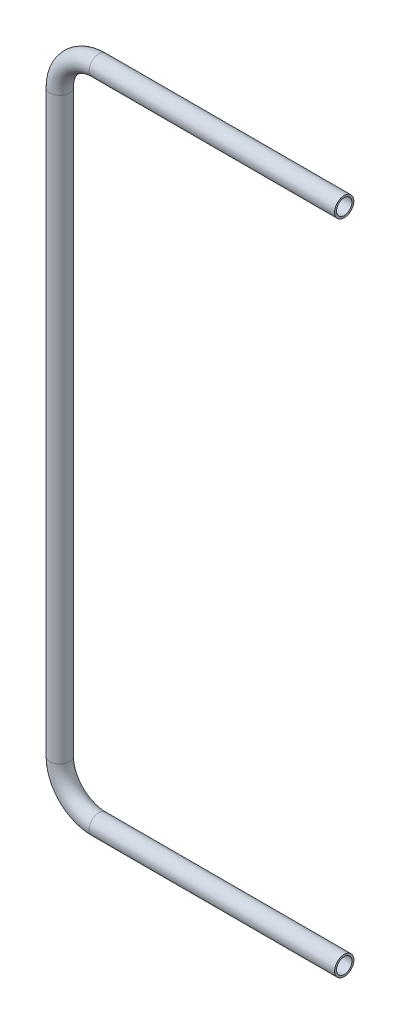
ISO-10303-21;
HEADER;
FILE_DESCRIPTION(('STEP AP214'),'2;1');
FILE_NAME('part.step','',(''),(''),'','','');
FILE_SCHEMA(('AUTOMOTIVE_DESIGN { 1 0 10303 214 1 1 1 1 }'));
ENDSEC;
DATA;
#1=APPLICATION_CONTEXT('core data for automotive mechanical design processes');
#2=APPLICATION_PROTOCOL_DEFINITION('international standard','automotive_design',2000,#1);
#3=PRODUCT_CONTEXT('',#1,'mechanical');
#4=PRODUCT('Part','Part','',(#3));
#5=PRODUCT_RELATED_PRODUCT_CATEGORY('part','',(#4));
#6=PRODUCT_DEFINITION_FORMATION('','',#4);
#7=PRODUCT_DEFINITION_CONTEXT('part definition',#1,'design');
#8=PRODUCT_DEFINITION('design','',#6,#7);
#9=PRODUCT_DEFINITION_SHAPE('','',#8);
#10=(LENGTH_UNIT() NAMED_UNIT(*) SI_UNIT(.MILLI.,.METRE.));
#11=(NAMED_UNIT(*) PLANE_ANGLE_UNIT() SI_UNIT($,.RADIAN.));
#12=(NAMED_UNIT(*) SI_UNIT($,.STERADIAN.) SOLID_ANGLE_UNIT());
#13=UNCERTAINTY_MEASURE_WITH_UNIT(LENGTH_MEASURE(1.E-05),#10,'distance_accuracy_value','');
#14=(GEOMETRIC_REPRESENTATION_CONTEXT(3) GLOBAL_UNCERTAINTY_ASSIGNED_CONTEXT((#13)) GLOBAL_UNIT_ASSIGNED_CONTEXT((#10,
#11,#12)) REPRESENTATION_CONTEXT('',''));
#15=CARTESIAN_POINT('',(0.,0.,0.));
#16=DIRECTION('',(0.,0.,1.));
#17=DIRECTION('',(1.,0.,0.));
#18=AXIS2_PLACEMENT_3D('',#15,#16,#17);
#19=CARTESIAN_POINT('',(0.,0.,0.));
#20=DIRECTION('',(-1.,0.,0.));
#21=DIRECTION('',(0.,-1.,0.));
#22=AXIS2_PLACEMENT_3D('',#19,#20,#21);
#23=CYLINDRICAL_SURFACE('',#22,16.7005);
#24=CARTESIAN_POINT('',(-423.799,0.,0.));
#25=DIRECTION('',(1.,0.,0.));
#26=DIRECTION('',(0.,0.,-1.));
#27=AXIS2_PLACEMENT_3D('',#24,#25,#26);
#28=CIRCLE('',#27,16.7005);
#29=CARTESIAN_POINT('',(-423.799,-16.7005000000001,0.));
#30=VERTEX_POINT('',#29);
#31=EDGE_CURVE('E113',#30,#30,#28,.T.);
#32=ORIENTED_EDGE('',*,*,#31,.T.);
#33=EDGE_LOOP('',(#32));
#34=FACE_BOUND('',#33,.T.);
#35=CARTESIAN_POINT('',(0.,0.,0.));
#36=DIRECTION('',(1.,0.,0.));
#37=DIRECTION('',(0.,0.,-1.));
#38=AXIS2_PLACEMENT_3D('',#35,#36,#37);
#39=CIRCLE('',#38,16.7005);
#40=CARTESIAN_POINT('',(0.,0.,-16.7005));
#41=VERTEX_POINT('',#40);
#42=EDGE_CURVE('E47',#41,#41,#39,.T.);
#43=ORIENTED_EDGE('',*,*,#42,.F.);
#44=EDGE_LOOP('',(#43));
#45=FACE_BOUND('',#44,.T.);
#46=ADVANCED_FACE('F32',(#34,#45),#23,.T.);
#47=CARTESIAN_POINT('',(-423.799,67.5005,0.));
#48=DIRECTION('',(0.,0.,-1.));
#49=DIRECTION('',(-1.,0.,0.));
#50=AXIS2_PLACEMENT_3D('',#47,#48,#49);
#51=TOROIDAL_SURFACE('',#50,67.5005,16.7005);
#52=CARTESIAN_POINT('',(-491.2995,67.5005,0.));
#53=DIRECTION('',(0.,-1.,0.));
#54=DIRECTION('',(0.,0.,-1.));
#55=AXIS2_PLACEMENT_3D('',#52,#53,#54);
#56=CIRCLE('',#55,16.7005);
#57=CARTESIAN_POINT('',(-508.,67.5005,0.));
#58=VERTEX_POINT('',#57);
#59=EDGE_CURVE('E116',#58,#58,#56,.T.);
#60=CARTESIAN_POINT('',(-423.799,67.5005,0.));
#61=DIRECTION('',(0.,0.,-1.));
#62=DIRECTION('',(-1.,0.,0.));
#63=AXIS2_PLACEMENT_3D('',#60,#61,#62);
#64=CIRCLE('',#63,84.201);
#65=EDGE_CURVE('',#30,#58,#64,.T.);
#66=ORIENTED_EDGE('',*,*,#31,.F.);
#67=ORIENTED_EDGE('',*,*,#59,.T.);
#68=ORIENTED_EDGE('',*,*,#65,.T.);
#69=ORIENTED_EDGE('',*,*,#65,.F.);
#70=EDGE_LOOP('',(#66,#68,#67,#69));
#71=FACE_BOUND('',#70,.T.);
#72=ADVANCED_FACE('F137',(#71),#51,.T.);
#73=CARTESIAN_POINT('',(-491.2995,67.5005,0.));
#74=DIRECTION('',(0.,1.,0.));
#75=DIRECTION('',(-1.,0.,0.));
#76=AXIS2_PLACEMENT_3D('',#73,#74,#75);
#77=CYLINDRICAL_SURFACE('',#76,16.7005);
#78=CARTESIAN_POINT('',(-491.2995,1067.562,0.));
#79=DIRECTION('',(0.,-1.,0.));
#80=DIRECTION('',(0.,0.,-1.));
#81=AXIS2_PLACEMENT_3D('',#78,#79,#80);
#82=CIRCLE('',#81,16.7005);
#83=CARTESIAN_POINT('',(-508.,1067.562,0.));
#84=VERTEX_POINT('',#83);
#85=EDGE_CURVE('E118',#84,#84,#82,.T.);
#86=ORIENTED_EDGE('',*,*,#85,.T.);
#87=EDGE_LOOP('',(#86));
#88=FACE_BOUND('',#87,.T.);
#89=ORIENTED_EDGE('',*,*,#59,.F.);
#90=EDGE_LOOP('',(#89));
#91=FACE_BOUND('',#90,.T.);
#92=ADVANCED_FACE('F133',(#88,#91),#77,.T.);
#93=CARTESIAN_POINT('',(-423.799,1067.562,0.));
#94=DIRECTION('',(0.,0.,-1.));
#95=DIRECTION('',(-1.,0.,0.));
#96=AXIS2_PLACEMENT_3D('',#93,#94,#95);
#97=TOROIDAL_SURFACE('',#96,67.5005,16.7005);
#98=CARTESIAN_POINT('',(-423.799,1135.0625,0.));
#99=DIRECTION('',(-1.,0.,0.));
#100=DIRECTION('',(0.,0.,-1.));
#101=AXIS2_PLACEMENT_3D('',#98,#99,#100);
#102=CIRCLE('',#101,16.7005);
#103=CARTESIAN_POINT('',(-423.799,1151.763,0.));
#104=VERTEX_POINT('',#103);
#105=EDGE_CURVE('E36',#104,#104,#102,.T.);
#106=CARTESIAN_POINT('',(-423.799,1067.562,0.));
#107=DIRECTION('',(0.,0.,-1.));
#108=DIRECTION('',(-1.,0.,0.));
#109=AXIS2_PLACEMENT_3D('',#106,#107,#108);
#110=CIRCLE('',#109,84.201);
#111=EDGE_CURVE('',#84,#104,#110,.T.);
#112=ORIENTED_EDGE('',*,*,#85,.F.);
#113=ORIENTED_EDGE('',*,*,#105,.T.);
#114=ORIENTED_EDGE('',*,*,#111,.T.);
#115=ORIENTED_EDGE('',*,*,#111,.F.);
#116=EDGE_LOOP('',(#112,#114,#113,#115));
#117=FACE_BOUND('',#116,.T.);
#118=ADVANCED_FACE('F125',(#117),#97,.T.);
#119=CARTESIAN_POINT('',(-423.799,1135.0625,0.));
#120=DIRECTION('',(1.,0.,0.));
#121=DIRECTION('',(0.,0.,-1.));
#122=AXIS2_PLACEMENT_3D('',#119,#120,#121);
#123=CYLINDRICAL_SURFACE('',#122,16.7005);
#124=CARTESIAN_POINT('',(-3.33066907387547E-13,1135.0625,0.));
#125=DIRECTION('',(-1.,0.,0.));
#126=DIRECTION('',(0.,0.,-1.));
#127=AXIS2_PLACEMENT_3D('',#124,#125,#126);
#128=CIRCLE('',#127,16.7005);
#129=CARTESIAN_POINT('',(-3.33066907387547E-13,1135.0625,-16.7005));
#130=VERTEX_POINT('',#129);
#131=EDGE_CURVE('E52',#130,#130,#128,.T.);
#132=ORIENTED_EDGE('',*,*,#131,.T.);
#133=EDGE_LOOP('',(#132));
#134=FACE_BOUND('',#133,.T.);
#135=ORIENTED_EDGE('',*,*,#105,.F.);
#136=EDGE_LOOP('',(#135));
#137=FACE_BOUND('',#136,.T.);
#138=ADVANCED_FACE('F34',(#134,#137),#123,.T.);
#139=CARTESIAN_POINT('',(0.,0.,0.));
#140=DIRECTION('',(1.,0.,0.));
#141=DIRECTION('',(0.,0.,-1.));
#142=AXIS2_PLACEMENT_3D('',#139,#140,#141);
#143=PLANE('',#142);
#144=CARTESIAN_POINT('',(0.,0.,0.));
#145=DIRECTION('',(1.,0.,0.));
#146=DIRECTION('',(0.,0.,-1.));
#147=AXIS2_PLACEMENT_3D('',#144,#145,#146);
#148=CIRCLE('',#147,13.335);
#149=CARTESIAN_POINT('',(0.,0.,-13.335));
#150=VERTEX_POINT('',#149);
#151=EDGE_CURVE('E100',#150,#150,#148,.F.);
#152=ORIENTED_EDGE('',*,*,#151,.T.);
#153=EDGE_LOOP('',(#152));
#154=FACE_BOUND('',#153,.T.);
#155=ORIENTED_EDGE('',*,*,#42,.T.);
#156=EDGE_LOOP('',(#155));
#157=FACE_BOUND('',#156,.T.);
#158=ADVANCED_FACE('F65',(#154,#157),#143,.T.);
#159=CARTESIAN_POINT('',(-3.33066907387547E-13,1135.0625,0.));
#160=DIRECTION('',(-1.,0.,0.));
#161=DIRECTION('',(0.,0.,-1.));
#162=AXIS2_PLACEMENT_3D('',#159,#160,#161);
#163=PLANE('',#162);
#164=CARTESIAN_POINT('',(-3.33066907387547E-13,1135.0625,0.));
#165=DIRECTION('',(-1.,0.,0.));
#166=DIRECTION('',(0.,0.,-1.));
#167=AXIS2_PLACEMENT_3D('',#164,#165,#166);
#168=CIRCLE('',#167,13.335);
#169=CARTESIAN_POINT('',(-3.33066907387547E-13,1135.0625,-13.335));
#170=VERTEX_POINT('',#169);
#171=EDGE_CURVE('E11',#170,#170,#168,.F.);
#172=ORIENTED_EDGE('',*,*,#171,.F.);
#173=EDGE_LOOP('',(#172));
#174=FACE_BOUND('',#173,.T.);
#175=ORIENTED_EDGE('',*,*,#131,.F.);
#176=EDGE_LOOP('',(#175));
#177=FACE_BOUND('',#176,.T.);
#178=ADVANCED_FACE('F62',(#174,#177),#163,.F.);
#179=CARTESIAN_POINT('',(0.,0.,0.));
#180=DIRECTION('',(-1.,0.,0.));
#181=DIRECTION('',(0.,-1.,0.));
#182=AXIS2_PLACEMENT_3D('',#179,#180,#181);
#183=CYLINDRICAL_SURFACE('',#182,13.335);
#184=CARTESIAN_POINT('',(-423.799,0.,0.));
#185=DIRECTION('',(1.,0.,0.));
#186=DIRECTION('',(0.,0.,-1.));
#187=AXIS2_PLACEMENT_3D('',#184,#185,#186);
#188=CIRCLE('',#187,13.335);
#189=CARTESIAN_POINT('',(-423.799,-13.3350000000001,0.));
#190=VERTEX_POINT('',#189);
#191=EDGE_CURVE('E99',#190,#190,#188,.F.);
#192=ORIENTED_EDGE('',*,*,#191,.T.);
#193=EDGE_LOOP('',(#192));
#194=FACE_BOUND('',#193,.T.);
#195=ORIENTED_EDGE('',*,*,#151,.F.);
#196=EDGE_LOOP('',(#195));
#197=FACE_BOUND('',#196,.T.);
#198=ADVANCED_FACE('F64',(#194,#197),#183,.F.);
#199=CARTESIAN_POINT('',(-423.799,67.5005,0.));
#200=DIRECTION('',(0.,0.,-1.));
#201=DIRECTION('',(-1.,0.,0.));
#202=AXIS2_PLACEMENT_3D('',#199,#200,#201);
#203=TOROIDAL_SURFACE('',#202,67.5005,13.335);
#204=CARTESIAN_POINT('',(-491.2995,67.5005,0.));
#205=DIRECTION('',(0.,-1.,0.));
#206=DIRECTION('',(0.,0.,-1.));
#207=AXIS2_PLACEMENT_3D('',#204,#205,#206);
#208=CIRCLE('',#207,13.335);
#209=CARTESIAN_POINT('',(-504.6345,67.5005,0.));
#210=VERTEX_POINT('',#209);
#211=EDGE_CURVE('E96',#210,#210,#208,.F.);
#212=CARTESIAN_POINT('',(-423.799,67.5005,0.));
#213=DIRECTION('',(0.,0.,-1.));
#214=DIRECTION('',(-1.,0.,0.));
#215=AXIS2_PLACEMENT_3D('',#212,#213,#214);
#216=CIRCLE('',#215,80.8355);
#217=EDGE_CURVE('',#190,#210,#216,.T.);
#218=ORIENTED_EDGE('',*,*,#191,.F.);
#219=ORIENTED_EDGE('',*,*,#211,.T.);
#220=ORIENTED_EDGE('',*,*,#217,.T.);
#221=ORIENTED_EDGE('',*,*,#217,.F.);
#222=EDGE_LOOP('',(#218,#220,#219,#221));
#223=FACE_BOUND('',#222,.T.);
#224=ADVANCED_FACE('F71',(#223),#203,.F.);
#225=CARTESIAN_POINT('',(-491.2995,67.5005,0.));
#226=DIRECTION('',(0.,1.,0.));
#227=DIRECTION('',(-1.,0.,0.));
#228=AXIS2_PLACEMENT_3D('',#225,#226,#227);
#229=CYLINDRICAL_SURFACE('',#228,13.335);
#230=CARTESIAN_POINT('',(-491.2995,1067.562,0.));
#231=DIRECTION('',(0.,-1.,0.));
#232=DIRECTION('',(0.,0.,-1.));
#233=AXIS2_PLACEMENT_3D('',#230,#231,#232);
#234=CIRCLE('',#233,13.335);
#235=CARTESIAN_POINT('',(-504.6345,1067.562,0.));
#236=VERTEX_POINT('',#235);
#237=EDGE_CURVE('E102',#236,#236,#234,.F.);
#238=ORIENTED_EDGE('',*,*,#237,.T.);
#239=EDGE_LOOP('',(#238));
#240=FACE_BOUND('',#239,.T.);
#241=ORIENTED_EDGE('',*,*,#211,.F.);
#242=EDGE_LOOP('',(#241));
#243=FACE_BOUND('',#242,.T.);
#244=ADVANCED_FACE('F82',(#240,#243),#229,.F.);
#245=CARTESIAN_POINT('',(-423.799,1067.562,0.));
#246=DIRECTION('',(0.,0.,-1.));
#247=DIRECTION('',(-1.,0.,0.));
#248=AXIS2_PLACEMENT_3D('',#245,#246,#247);
#249=TOROIDAL_SURFACE('',#248,67.5005,13.335);
#250=CARTESIAN_POINT('',(-423.799,1135.0625,0.));
#251=DIRECTION('',(-1.,0.,0.));
#252=DIRECTION('',(0.,0.,-1.));
#253=AXIS2_PLACEMENT_3D('',#250,#251,#252);
#254=CIRCLE('',#253,13.335);
#255=CARTESIAN_POINT('',(-423.799,1148.3975,0.));
#256=VERTEX_POINT('',#255);
#257=EDGE_CURVE('E41',#256,#256,#254,.F.);
#258=CARTESIAN_POINT('',(-423.799,1067.562,0.));
#259=DIRECTION('',(0.,0.,-1.));
#260=DIRECTION('',(-1.,0.,0.));
#261=AXIS2_PLACEMENT_3D('',#258,#259,#260);
#262=CIRCLE('',#261,80.8355);
#263=EDGE_CURVE('',#236,#256,#262,.T.);
#264=ORIENTED_EDGE('',*,*,#237,.F.);
#265=ORIENTED_EDGE('',*,*,#257,.T.);
#266=ORIENTED_EDGE('',*,*,#263,.T.);
#267=ORIENTED_EDGE('',*,*,#263,.F.);
#268=EDGE_LOOP('',(#264,#266,#265,#267));
#269=FACE_BOUND('',#268,.T.);
#270=ADVANCED_FACE('F78',(#269),#249,.F.);
#271=CARTESIAN_POINT('',(-423.799,1135.0625,0.));
#272=DIRECTION('',(1.,0.,0.));
#273=DIRECTION('',(0.,0.,-1.));
#274=AXIS2_PLACEMENT_3D('',#271,#272,#273);
#275=CYLINDRICAL_SURFACE('',#274,13.335);
#276=ORIENTED_EDGE('',*,*,#171,.T.);
#277=EDGE_LOOP('',(#276));
#278=FACE_BOUND('',#277,.T.);
#279=ORIENTED_EDGE('',*,*,#257,.F.);
#280=EDGE_LOOP('',(#279));
#281=FACE_BOUND('',#280,.T.);
#282=ADVANCED_FACE('F59',(#278,#281),#275,.F.);
#283=CLOSED_SHELL('',(#46,#72,#92,#118,#138,#158,#178,#198,#224,#244,#270,#282));
#284=MANIFOLD_SOLID_BREP('B2',#283);
#285=ADVANCED_BREP_SHAPE_REPRESENTATION('',(#18,#284),#14);
#286=SHAPE_DEFINITION_REPRESENTATION(#9,#285);
ENDSEC;
END-ISO-10303-21;
